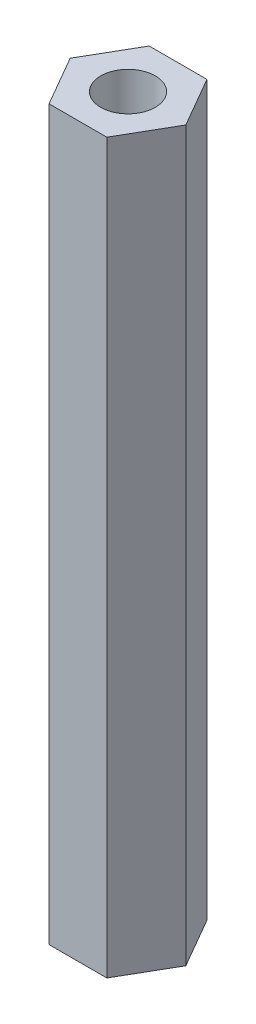
ISO-10303-21;
HEADER;
FILE_DESCRIPTION(('STEP AP214'),'2;1');
FILE_NAME('part.step','',(''),(''),'','','');
FILE_SCHEMA(('AUTOMOTIVE_DESIGN { 1 0 10303 214 1 1 1 1 }'));
ENDSEC;
DATA;
#1=APPLICATION_CONTEXT('core data for automotive mechanical design processes');
#2=APPLICATION_PROTOCOL_DEFINITION('international standard','automotive_design',2000,#1);
#3=PRODUCT_CONTEXT('',#1,'mechanical');
#4=PRODUCT('Part','Part','',(#3));
#5=PRODUCT_RELATED_PRODUCT_CATEGORY('part','',(#4));
#6=PRODUCT_DEFINITION_FORMATION('','',#4);
#7=PRODUCT_DEFINITION_CONTEXT('part definition',#1,'design');
#8=PRODUCT_DEFINITION('design','',#6,#7);
#9=PRODUCT_DEFINITION_SHAPE('','',#8);
#10=(LENGTH_UNIT() NAMED_UNIT(*) SI_UNIT(.MILLI.,.METRE.));
#11=(NAMED_UNIT(*) PLANE_ANGLE_UNIT() SI_UNIT($,.RADIAN.));
#12=(NAMED_UNIT(*) SI_UNIT($,.STERADIAN.) SOLID_ANGLE_UNIT());
#13=UNCERTAINTY_MEASURE_WITH_UNIT(LENGTH_MEASURE(1.E-05),#10,'distance_accuracy_value','');
#14=(GEOMETRIC_REPRESENTATION_CONTEXT(3) GLOBAL_UNCERTAINTY_ASSIGNED_CONTEXT((#13)) GLOBAL_UNIT_ASSIGNED_CONTEXT((#10,
#11,#12)) REPRESENTATION_CONTEXT('',''));
#15=CARTESIAN_POINT('',(0.,0.,0.));
#16=DIRECTION('',(0.,0.,1.));
#17=DIRECTION('',(1.,0.,0.));
#18=AXIS2_PLACEMENT_3D('',#15,#16,#17);
#19=CARTESIAN_POINT('',(1.5877132402715,40.,2.74999999999997));
#20=DIRECTION('',(-0.866025403784442,0.,-0.499999999999995));
#21=DIRECTION('',(-0.499999999999995,0.,0.866025403784442));
#22=AXIS2_PLACEMENT_3D('',#19,#20,#21);
#23=PLANE('',#22);
#24=DIRECTION('',(0.499999999999995,0.,-0.866025403784441));
#25=VECTOR('',#24,1.);
#26=CARTESIAN_POINT('',(1.5877132402715,0.,2.74999999999997));
#27=LINE('',#26,#25);
#28=CARTESIAN_POINT('',(1.5877132402715,0.,2.74999999999997));
#29=VERTEX_POINT('',#28);
#30=CARTESIAN_POINT('',(3.17542648054293,0.,0.));
#31=VERTEX_POINT('',#30);
#32=EDGE_CURVE('E117',#29,#31,#27,.T.);
#33=ORIENTED_EDGE('',*,*,#32,.T.);
#34=DIRECTION('',(0.,-1.,0.));
#35=VECTOR('',#34,1.);
#36=CARTESIAN_POINT('',(3.17542648054293,40.,0.));
#37=LINE('',#36,#35);
#38=CARTESIAN_POINT('',(3.17542648054293,40.,0.));
#39=VERTEX_POINT('',#38);
#40=EDGE_CURVE('E11',#39,#31,#37,.T.);
#41=ORIENTED_EDGE('',*,*,#40,.F.);
#42=DIRECTION('',(0.499999999999995,0.,-0.866025403784441));
#43=VECTOR('',#42,1.);
#44=CARTESIAN_POINT('',(1.5877132402715,40.,2.74999999999997));
#45=LINE('',#44,#43);
#46=CARTESIAN_POINT('',(1.5877132402715,40.,2.74999999999997));
#47=VERTEX_POINT('',#46);
#48=EDGE_CURVE('E128',#47,#39,#45,.T.);
#49=ORIENTED_EDGE('',*,*,#48,.F.);
#50=DIRECTION('',(0.,-1.,0.));
#51=VECTOR('',#50,1.);
#52=CARTESIAN_POINT('',(1.5877132402715,40.,2.74999999999997));
#53=LINE('',#52,#51);
#54=EDGE_CURVE('E113',#47,#29,#53,.T.);
#55=ORIENTED_EDGE('',*,*,#54,.T.);
#56=EDGE_LOOP('',(#33,#41,#49,#55));
#57=FACE_BOUND('',#56,.T.);
#58=ADVANCED_FACE('F33',(#57),#23,.F.);
#59=CARTESIAN_POINT('',(3.17542648054293,40.,0.));
#60=DIRECTION('',(-0.866025403784438,0.,0.500000000000001));
#61=DIRECTION('',(0.500000000000001,0.,0.866025403784438));
#62=AXIS2_PLACEMENT_3D('',#59,#60,#61);
#63=PLANE('',#62);
#64=DIRECTION('',(-0.500000000000001,0.,-0.866025403784438));
#65=VECTOR('',#64,1.);
#66=CARTESIAN_POINT('',(3.17542648054293,0.,0.));
#67=LINE('',#66,#65);
#68=CARTESIAN_POINT('',(1.58771324027146,0.,-2.74999999999999));
#69=VERTEX_POINT('',#68);
#70=EDGE_CURVE('E120',#31,#69,#67,.T.);
#71=ORIENTED_EDGE('',*,*,#70,.T.);
#72=DIRECTION('',(0.,-1.,0.));
#73=VECTOR('',#72,1.);
#74=CARTESIAN_POINT('',(1.58771324027146,40.,-2.74999999999999));
#75=LINE('',#74,#73);
#76=CARTESIAN_POINT('',(1.58771324027146,40.,-2.74999999999999));
#77=VERTEX_POINT('',#76);
#78=EDGE_CURVE('E41',#77,#69,#75,.T.);
#79=ORIENTED_EDGE('',*,*,#78,.F.);
#80=DIRECTION('',(-0.500000000000001,0.,-0.866025403784438));
#81=VECTOR('',#80,1.);
#82=CARTESIAN_POINT('',(3.17542648054293,40.,0.));
#83=LINE('',#82,#81);
#84=EDGE_CURVE('E86',#39,#77,#83,.T.);
#85=ORIENTED_EDGE('',*,*,#84,.F.);
#86=ORIENTED_EDGE('',*,*,#40,.T.);
#87=EDGE_LOOP('',(#71,#79,#85,#86));
#88=FACE_BOUND('',#87,.T.);
#89=ADVANCED_FACE('F153',(#88),#63,.F.);
#90=CARTESIAN_POINT('',(1.58771324027146,40.,-2.74999999999999));
#91=DIRECTION('',(0.,0.,1.));
#92=DIRECTION('',(1.,0.,0.));
#93=AXIS2_PLACEMENT_3D('',#90,#91,#92);
#94=PLANE('',#93);
#95=DIRECTION('',(-1.,0.,0.));
#96=VECTOR('',#95,1.);
#97=CARTESIAN_POINT('',(1.58771324027146,0.,-2.74999999999999));
#98=LINE('',#97,#96);
#99=CARTESIAN_POINT('',(-1.58771324027148,0.,-2.74999999999998));
#100=VERTEX_POINT('',#99);
#101=EDGE_CURVE('E123',#69,#100,#98,.T.);
#102=ORIENTED_EDGE('',*,*,#101,.T.);
#103=DIRECTION('',(0.,-1.,0.));
#104=VECTOR('',#103,1.);
#105=CARTESIAN_POINT('',(-1.58771324027148,40.,-2.74999999999998));
#106=LINE('',#105,#104);
#107=CARTESIAN_POINT('',(-1.58771324027148,40.,-2.74999999999998));
#108=VERTEX_POINT('',#107);
#109=EDGE_CURVE('E108',#108,#100,#106,.T.);
#110=ORIENTED_EDGE('',*,*,#109,.F.);
#111=DIRECTION('',(-1.,0.,0.));
#112=VECTOR('',#111,1.);
#113=CARTESIAN_POINT('',(1.58771324027146,40.,-2.74999999999999));
#114=LINE('',#113,#112);
#115=EDGE_CURVE('E99',#77,#108,#114,.T.);
#116=ORIENTED_EDGE('',*,*,#115,.F.);
#117=ORIENTED_EDGE('',*,*,#78,.T.);
#118=EDGE_LOOP('',(#102,#110,#116,#117));
#119=FACE_BOUND('',#118,.T.);
#120=ADVANCED_FACE('F134',(#119),#94,.F.);
#121=CARTESIAN_POINT('',(-1.58771324027148,40.,-2.74999999999998));
#122=DIRECTION('',(0.866025403784442,0.,0.499999999999995));
#123=DIRECTION('',(0.499999999999995,0.,-0.866025403784442));
#124=AXIS2_PLACEMENT_3D('',#121,#122,#123);
#125=PLANE('',#124);
#126=DIRECTION('',(-0.499999999999995,0.,0.866025403784442));
#127=VECTOR('',#126,1.);
#128=CARTESIAN_POINT('',(-1.58771324027148,0.,-2.74999999999998));
#129=LINE('',#128,#127);
#130=CARTESIAN_POINT('',(-3.17542648054293,0.,0.));
#131=VERTEX_POINT('',#130);
#132=EDGE_CURVE('E107',#100,#131,#129,.T.);
#133=ORIENTED_EDGE('',*,*,#132,.T.);
#134=DIRECTION('',(0.,-1.,0.));
#135=VECTOR('',#134,1.);
#136=CARTESIAN_POINT('',(-3.17542648054293,40.,0.));
#137=LINE('',#136,#135);
#138=CARTESIAN_POINT('',(-3.17542648054293,40.,0.));
#139=VERTEX_POINT('',#138);
#140=EDGE_CURVE('E104',#139,#131,#137,.T.);
#141=ORIENTED_EDGE('',*,*,#140,.F.);
#142=DIRECTION('',(-0.499999999999995,0.,0.866025403784442));
#143=VECTOR('',#142,1.);
#144=CARTESIAN_POINT('',(-1.58771324027148,40.,-2.74999999999998));
#145=LINE('',#144,#143);
#146=EDGE_CURVE('E93',#108,#139,#145,.T.);
#147=ORIENTED_EDGE('',*,*,#146,.F.);
#148=ORIENTED_EDGE('',*,*,#109,.T.);
#149=EDGE_LOOP('',(#133,#141,#147,#148));
#150=FACE_BOUND('',#149,.T.);
#151=ADVANCED_FACE('F105',(#150),#125,.F.);
#152=CARTESIAN_POINT('',(-3.17542648054293,40.,0.));
#153=DIRECTION('',(0.866025403784435,0.,-0.500000000000007));
#154=DIRECTION('',(-0.500000000000007,0.,-0.866025403784435));
#155=AXIS2_PLACEMENT_3D('',#152,#153,#154);
#156=PLANE('',#155);
#157=DIRECTION('',(0.500000000000007,0.,0.866025403784435));
#158=VECTOR('',#157,1.);
#159=CARTESIAN_POINT('',(-3.17542648054293,0.,0.));
#160=LINE('',#159,#158);
#161=CARTESIAN_POINT('',(-1.58771324027144,0.,2.75));
#162=VERTEX_POINT('',#161);
#163=EDGE_CURVE('E72',#131,#162,#160,.T.);
#164=ORIENTED_EDGE('',*,*,#163,.T.);
#165=DIRECTION('',(0.,-1.,0.));
#166=VECTOR('',#165,1.);
#167=CARTESIAN_POINT('',(-1.58771324027144,40.,2.75));
#168=LINE('',#167,#166);
#169=CARTESIAN_POINT('',(-1.58771324027144,40.,2.75));
#170=VERTEX_POINT('',#169);
#171=EDGE_CURVE('E109',#170,#162,#168,.T.);
#172=ORIENTED_EDGE('',*,*,#171,.F.);
#173=DIRECTION('',(0.500000000000007,0.,0.866025403784435));
#174=VECTOR('',#173,1.);
#175=CARTESIAN_POINT('',(-3.17542648054293,40.,0.));
#176=LINE('',#175,#174);
#177=EDGE_CURVE('E97',#139,#170,#176,.T.);
#178=ORIENTED_EDGE('',*,*,#177,.F.);
#179=ORIENTED_EDGE('',*,*,#140,.T.);
#180=EDGE_LOOP('',(#164,#172,#178,#179));
#181=FACE_BOUND('',#180,.T.);
#182=ADVANCED_FACE('F111',(#181),#156,.F.);
#183=CARTESIAN_POINT('',(-1.58771324027144,40.,2.75));
#184=DIRECTION('',(0.,0.,-1.));
#185=DIRECTION('',(-1.,0.,0.));
#186=AXIS2_PLACEMENT_3D('',#183,#184,#185);
#187=PLANE('',#186);
#188=DIRECTION('',(1.,0.,0.));
#189=VECTOR('',#188,1.);
#190=CARTESIAN_POINT('',(-1.58771324027144,0.,2.75));
#191=LINE('',#190,#189);
#192=EDGE_CURVE('E78',#162,#29,#191,.T.);
#193=ORIENTED_EDGE('',*,*,#192,.T.);
#194=ORIENTED_EDGE('',*,*,#54,.F.);
#195=DIRECTION('',(1.,0.,0.));
#196=VECTOR('',#195,1.);
#197=CARTESIAN_POINT('',(-1.58771324027144,40.,2.75));
#198=LINE('',#197,#196);
#199=EDGE_CURVE('E49',#170,#47,#198,.T.);
#200=ORIENTED_EDGE('',*,*,#199,.F.);
#201=ORIENTED_EDGE('',*,*,#171,.T.);
#202=EDGE_LOOP('',(#193,#194,#200,#201));
#203=FACE_BOUND('',#202,.T.);
#204=ADVANCED_FACE('F141',(#203),#187,.F.);
#205=CARTESIAN_POINT('',(0.,40.,0.));
#206=DIRECTION('',(0.,1.,0.));
#207=DIRECTION('',(0.,0.,1.));
#208=AXIS2_PLACEMENT_3D('',#205,#206,#207);
#209=PLANE('',#208);
#210=CARTESIAN_POINT('',(0.,40.,0.));
#211=DIRECTION('',(0.,1.,0.));
#212=DIRECTION('',(0.,0.,1.));
#213=AXIS2_PLACEMENT_3D('',#210,#211,#212);
#214=CIRCLE('',#213,1.5);
#215=CARTESIAN_POINT('',(0.,40.,1.5));
#216=VERTEX_POINT('',#215);
#217=EDGE_CURVE('E236',#216,#216,#214,.T.);
#218=ORIENTED_EDGE('',*,*,#217,.F.);
#219=EDGE_LOOP('',(#218));
#220=FACE_BOUND('',#219,.T.);
#221=ORIENTED_EDGE('',*,*,#48,.T.);
#222=ORIENTED_EDGE('',*,*,#84,.T.);
#223=ORIENTED_EDGE('',*,*,#115,.T.);
#224=ORIENTED_EDGE('',*,*,#146,.T.);
#225=ORIENTED_EDGE('',*,*,#177,.T.);
#226=ORIENTED_EDGE('',*,*,#199,.T.);
#227=EDGE_LOOP('',(#221,#222,#223,#224,#225,#226));
#228=FACE_BOUND('',#227,.T.);
#229=ADVANCED_FACE('F95',(#220,#228),#209,.T.);
#230=CARTESIAN_POINT('',(0.,0.,0.));
#231=DIRECTION('',(0.,1.,0.));
#232=DIRECTION('',(0.,0.,1.));
#233=AXIS2_PLACEMENT_3D('',#230,#231,#232);
#234=PLANE('',#233);
#235=CARTESIAN_POINT('',(0.,0.,0.));
#236=DIRECTION('',(0.,1.,0.));
#237=DIRECTION('',(0.,0.,1.));
#238=AXIS2_PLACEMENT_3D('',#235,#236,#237);
#239=CIRCLE('',#238,1.5);
#240=CARTESIAN_POINT('',(0.,0.,1.5));
#241=VERTEX_POINT('',#240);
#242=EDGE_CURVE('E237',#241,#241,#239,.T.);
#243=ORIENTED_EDGE('',*,*,#242,.T.);
#244=EDGE_LOOP('',(#243));
#245=FACE_BOUND('',#244,.T.);
#246=ORIENTED_EDGE('',*,*,#32,.F.);
#247=ORIENTED_EDGE('',*,*,#192,.F.);
#248=ORIENTED_EDGE('',*,*,#163,.F.);
#249=ORIENTED_EDGE('',*,*,#132,.F.);
#250=ORIENTED_EDGE('',*,*,#101,.F.);
#251=ORIENTED_EDGE('',*,*,#70,.F.);
#252=EDGE_LOOP('',(#246,#247,#248,#249,#250,#251));
#253=FACE_BOUND('',#252,.T.);
#254=ADVANCED_FACE('F137',(#245,#253),#234,.F.);
#255=CARTESIAN_POINT('',(0.,30.,0.));
#256=DIRECTION('',(0.,1.,0.));
#257=DIRECTION('',(0.,0.,1.));
#258=AXIS2_PLACEMENT_3D('',#255,#256,#257);
#259=CYLINDRICAL_SURFACE('',#258,1.5);
#260=CARTESIAN_POINT('',(0.,30.,0.));
#261=DIRECTION('',(0.,1.,0.));
#262=DIRECTION('',(0.,0.,1.));
#263=AXIS2_PLACEMENT_3D('',#260,#261,#262);
#264=CIRCLE('',#263,1.5);
#265=CARTESIAN_POINT('',(0.,30.,1.5));
#266=VERTEX_POINT('',#265);
#267=EDGE_CURVE('E121',#266,#266,#264,.T.);
#268=ORIENTED_EDGE('',*,*,#267,.F.);
#269=EDGE_LOOP('',(#268));
#270=FACE_BOUND('',#269,.T.);
#271=ORIENTED_EDGE('',*,*,#217,.T.);
#272=EDGE_LOOP('',(#271));
#273=FACE_BOUND('',#272,.T.);
#274=ADVANCED_FACE('F188',(#270,#273),#259,.F.);
#275=CARTESIAN_POINT('',(0.,30.,0.));
#276=DIRECTION('',(0.,1.,0.));
#277=DIRECTION('',(0.,0.,1.));
#278=AXIS2_PLACEMENT_3D('',#275,#276,#277);
#279=PLANE('',#278);
#280=ORIENTED_EDGE('',*,*,#267,.T.);
#281=EDGE_LOOP('',(#280));
#282=FACE_BOUND('',#281,.T.);
#283=ADVANCED_FACE('F193',(#282),#279,.T.);
#284=CARTESIAN_POINT('',(0.,10.,0.));
#285=DIRECTION('',(0.,-1.,0.));
#286=DIRECTION('',(0.,0.,-1.));
#287=AXIS2_PLACEMENT_3D('',#284,#285,#286);
#288=CYLINDRICAL_SURFACE('',#287,1.5);
#289=CARTESIAN_POINT('',(0.,10.,0.));
#290=DIRECTION('',(0.,1.,0.));
#291=DIRECTION('',(0.,0.,1.));
#292=AXIS2_PLACEMENT_3D('',#289,#290,#291);
#293=CIRCLE('',#292,1.5);
#294=CARTESIAN_POINT('',(0.,10.,1.5));
#295=VERTEX_POINT('',#294);
#296=EDGE_CURVE('E235',#295,#295,#293,.T.);
#297=ORIENTED_EDGE('',*,*,#296,.T.);
#298=EDGE_LOOP('',(#297));
#299=FACE_BOUND('',#298,.T.);
#300=ORIENTED_EDGE('',*,*,#242,.F.);
#301=EDGE_LOOP('',(#300));
#302=FACE_BOUND('',#301,.T.);
#303=ADVANCED_FACE('F203',(#299,#302),#288,.F.);
#304=CARTESIAN_POINT('',(0.,10.,0.));
#305=DIRECTION('',(0.,-1.,0.));
#306=DIRECTION('',(0.,0.,1.));
#307=AXIS2_PLACEMENT_3D('',#304,#305,#306);
#308=PLANE('',#307);
#309=ORIENTED_EDGE('',*,*,#296,.F.);
#310=EDGE_LOOP('',(#309));
#311=FACE_BOUND('',#310,.T.);
#312=ADVANCED_FACE('F219',(#311),#308,.T.);
#313=CLOSED_SHELL('',(#58,#89,#120,#151,#182,#204,#229,#254,#274,#283,#303,#312));
#314=MANIFOLD_SOLID_BREP('B2',#313);
#315=ADVANCED_BREP_SHAPE_REPRESENTATION('',(#18,#314),#14);
#316=SHAPE_DEFINITION_REPRESENTATION(#9,#315);
ENDSEC;
END-ISO-10303-21;
